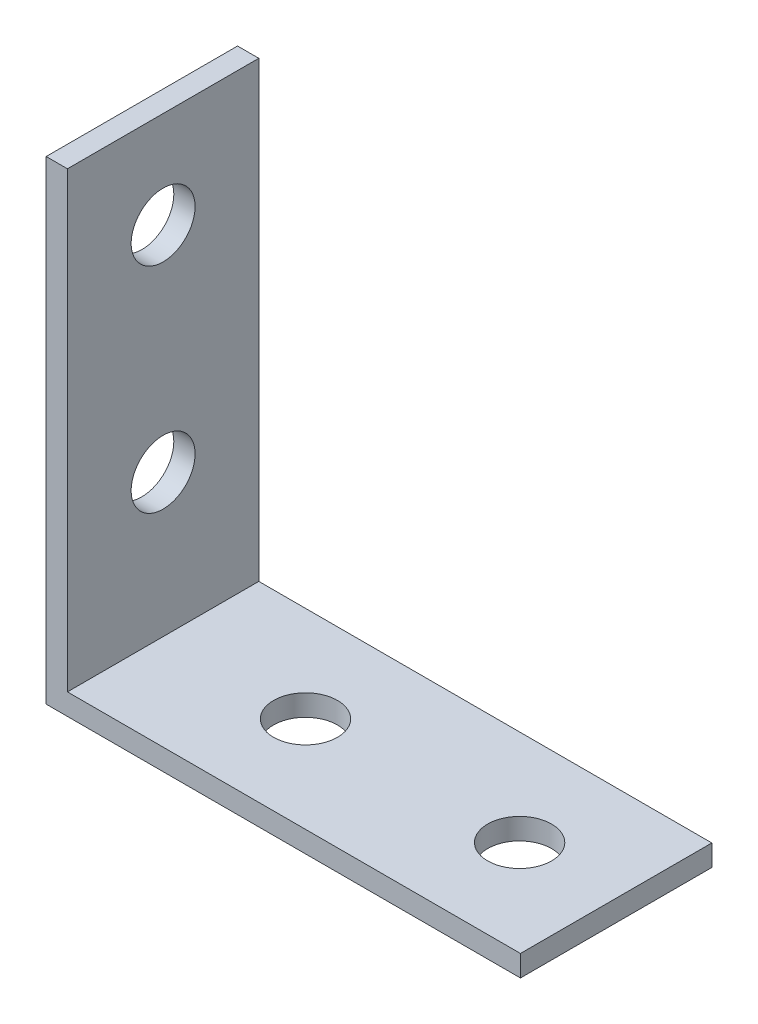
ISO-10303-21;
HEADER;
FILE_DESCRIPTION(('STEP AP214'),'2;1');
FILE_NAME('part.step','',(''),(''),'','','');
FILE_SCHEMA(('AUTOMOTIVE_DESIGN { 1 0 10303 214 1 1 1 1 }'));
ENDSEC;
DATA;
#1=APPLICATION_CONTEXT('core data for automotive mechanical design processes');
#2=APPLICATION_PROTOCOL_DEFINITION('international standard','automotive_design',2000,#1);
#3=PRODUCT_CONTEXT('',#1,'mechanical');
#4=PRODUCT('Part','Part','',(#3));
#5=PRODUCT_RELATED_PRODUCT_CATEGORY('part','',(#4));
#6=PRODUCT_DEFINITION_FORMATION('','',#4);
#7=PRODUCT_DEFINITION_CONTEXT('part definition',#1,'design');
#8=PRODUCT_DEFINITION('design','',#6,#7);
#9=PRODUCT_DEFINITION_SHAPE('','',#8);
#10=(LENGTH_UNIT() NAMED_UNIT(*) SI_UNIT(.MILLI.,.METRE.));
#11=(NAMED_UNIT(*) PLANE_ANGLE_UNIT() SI_UNIT($,.RADIAN.));
#12=(NAMED_UNIT(*) SI_UNIT($,.STERADIAN.) SOLID_ANGLE_UNIT());
#13=UNCERTAINTY_MEASURE_WITH_UNIT(LENGTH_MEASURE(1.E-05),#10,'distance_accuracy_value','');
#14=(GEOMETRIC_REPRESENTATION_CONTEXT(3) GLOBAL_UNCERTAINTY_ASSIGNED_CONTEXT((#13)) GLOBAL_UNIT_ASSIGNED_CONTEXT((#10,
#11,#12)) REPRESENTATION_CONTEXT('',''));
#15=CARTESIAN_POINT('',(0.,0.,0.));
#16=DIRECTION('',(0.,0.,1.));
#17=DIRECTION('',(1.,0.,0.));
#18=AXIS2_PLACEMENT_3D('',#15,#16,#17);
#19=CARTESIAN_POINT('',(0.,1.78,0.));
#20=DIRECTION('',(0.,-1.,0.));
#21=DIRECTION('',(0.,0.,-1.));
#22=AXIS2_PLACEMENT_3D('',#19,#20,#21);
#23=PLANE('',#22);
#24=CARTESIAN_POINT('',(31.62,1.78,-8.01));
#25=DIRECTION('',(0.,1.,0.));
#26=DIRECTION('',(0.,0.,1.));
#27=AXIS2_PLACEMENT_3D('',#24,#25,#26);
#28=CIRCLE('',#27,2.675);
#29=CARTESIAN_POINT('',(31.62,1.78,-5.335));
#30=VERTEX_POINT('',#29);
#31=EDGE_CURVE('E149',#30,#30,#28,.T.);
#32=ORIENTED_EDGE('',*,*,#31,.F.);
#33=EDGE_LOOP('',(#32));
#34=FACE_BOUND('',#33,.T.);
#35=CARTESIAN_POINT('',(13.7,1.78,-8.01));
#36=DIRECTION('',(0.,1.,0.));
#37=DIRECTION('',(0.,0.,1.));
#38=AXIS2_PLACEMENT_3D('',#35,#36,#37);
#39=CIRCLE('',#38,2.675);
#40=CARTESIAN_POINT('',(13.7,1.78,-5.335));
#41=VERTEX_POINT('',#40);
#42=EDGE_CURVE('E99',#41,#41,#39,.T.);
#43=ORIENTED_EDGE('',*,*,#42,.F.);
#44=EDGE_LOOP('',(#43));
#45=FACE_BOUND('',#44,.T.);
#46=DIRECTION('',(0.,0.,-1.));
#47=VECTOR('',#46,1.);
#48=CARTESIAN_POINT('',(1.78,1.78,0.));
#49=LINE('',#48,#47);
#50=CARTESIAN_POINT('',(1.78,1.78,0.));
#51=VERTEX_POINT('',#50);
#52=CARTESIAN_POINT('',(1.78,1.78,-16.02));
#53=VERTEX_POINT('',#52);
#54=EDGE_CURVE('E47',#51,#53,#49,.T.);
#55=ORIENTED_EDGE('',*,*,#54,.F.);
#56=DIRECTION('',(1.,0.,0.));
#57=VECTOR('',#56,1.);
#58=CARTESIAN_POINT('',(0.,1.78,0.));
#59=LINE('',#58,#57);
#60=CARTESIAN_POINT('',(39.7,1.78,0.));
#61=VERTEX_POINT('',#60);
#62=EDGE_CURVE('E84',#51,#61,#59,.T.);
#63=ORIENTED_EDGE('',*,*,#62,.T.);
#64=DIRECTION('',(0.,0.,-1.));
#65=VECTOR('',#64,1.);
#66=CARTESIAN_POINT('',(39.7,1.78,0.));
#67=LINE('',#66,#65);
#68=CARTESIAN_POINT('',(39.7,1.78,-16.02));
#69=VERTEX_POINT('',#68);
#70=EDGE_CURVE('E53',#61,#69,#67,.T.);
#71=ORIENTED_EDGE('',*,*,#70,.T.);
#72=DIRECTION('',(-1.,0.,0.));
#73=VECTOR('',#72,1.);
#74=CARTESIAN_POINT('',(0.,1.78,-16.02));
#75=LINE('',#74,#73);
#76=EDGE_CURVE('E94',#69,#53,#75,.T.);
#77=ORIENTED_EDGE('',*,*,#76,.T.);
#78=EDGE_LOOP('',(#55,#63,#71,#77));
#79=FACE_BOUND('',#78,.T.);
#80=ADVANCED_FACE('F32',(#34,#45,#79),#23,.F.);
#81=CARTESIAN_POINT('',(0.,0.,0.));
#82=DIRECTION('',(0.,-1.,0.));
#83=DIRECTION('',(0.,0.,-1.));
#84=AXIS2_PLACEMENT_3D('',#81,#82,#83);
#85=PLANE('',#84);
#86=CARTESIAN_POINT('',(13.7,0.,-8.01));
#87=DIRECTION('',(0.,1.,0.));
#88=DIRECTION('',(0.,0.,1.));
#89=AXIS2_PLACEMENT_3D('',#86,#87,#88);
#90=CIRCLE('',#89,2.675);
#91=CARTESIAN_POINT('',(13.7,0.,-5.335));
#92=VERTEX_POINT('',#91);
#93=EDGE_CURVE('E103',#92,#92,#90,.T.);
#94=ORIENTED_EDGE('',*,*,#93,.T.);
#95=EDGE_LOOP('',(#94));
#96=FACE_BOUND('',#95,.T.);
#97=DIRECTION('',(0.,0.,1.));
#98=VECTOR('',#97,1.);
#99=CARTESIAN_POINT('',(0.,0.,0.));
#100=LINE('',#99,#98);
#101=CARTESIAN_POINT('',(0.,0.,-16.02));
#102=VERTEX_POINT('',#101);
#103=CARTESIAN_POINT('',(0.,0.,0.));
#104=VERTEX_POINT('',#103);
#105=EDGE_CURVE('E91',#102,#104,#100,.T.);
#106=ORIENTED_EDGE('',*,*,#105,.F.);
#107=DIRECTION('',(-1.,0.,0.));
#108=VECTOR('',#107,1.);
#109=CARTESIAN_POINT('',(0.,0.,-16.02));
#110=LINE('',#109,#108);
#111=CARTESIAN_POINT('',(39.7,0.,-16.02));
#112=VERTEX_POINT('',#111);
#113=EDGE_CURVE('E73',#112,#102,#110,.T.);
#114=ORIENTED_EDGE('',*,*,#113,.F.);
#115=DIRECTION('',(0.,0.,-1.));
#116=VECTOR('',#115,1.);
#117=CARTESIAN_POINT('',(39.7,0.,0.));
#118=LINE('',#117,#116);
#119=CARTESIAN_POINT('',(39.7,0.,0.));
#120=VERTEX_POINT('',#119);
#121=EDGE_CURVE('E85',#120,#112,#118,.T.);
#122=ORIENTED_EDGE('',*,*,#121,.F.);
#123=DIRECTION('',(1.,0.,0.));
#124=VECTOR('',#123,1.);
#125=CARTESIAN_POINT('',(0.,0.,0.));
#126=LINE('',#125,#124);
#127=EDGE_CURVE('E98',#104,#120,#126,.T.);
#128=ORIENTED_EDGE('',*,*,#127,.F.);
#129=EDGE_LOOP('',(#106,#114,#122,#128));
#130=FACE_BOUND('',#129,.T.);
#131=CARTESIAN_POINT('',(31.62,0.,-8.01));
#132=DIRECTION('',(0.,1.,0.));
#133=DIRECTION('',(0.,0.,1.));
#134=AXIS2_PLACEMENT_3D('',#131,#132,#133);
#135=CIRCLE('',#134,2.675);
#136=CARTESIAN_POINT('',(31.62,0.,-5.335));
#137=VERTEX_POINT('',#136);
#138=EDGE_CURVE('E148',#137,#137,#135,.T.);
#139=ORIENTED_EDGE('',*,*,#138,.T.);
#140=EDGE_LOOP('',(#139));
#141=FACE_BOUND('',#140,.T.);
#142=ADVANCED_FACE('F96',(#96,#130,#141),#85,.T.);
#143=CARTESIAN_POINT('',(0.,1.78,0.));
#144=DIRECTION('',(1.,0.,0.));
#145=DIRECTION('',(0.,0.,-1.));
#146=AXIS2_PLACEMENT_3D('',#143,#144,#145);
#147=PLANE('',#146);
#148=CARTESIAN_POINT('',(0.,13.7,-8.01));
#149=DIRECTION('',(1.,0.,0.));
#150=DIRECTION('',(0.,0.,-1.));
#151=AXIS2_PLACEMENT_3D('',#148,#149,#150);
#152=CIRCLE('',#151,2.675);
#153=CARTESIAN_POINT('',(0.,13.7,-10.685));
#154=VERTEX_POINT('',#153);
#155=EDGE_CURVE('E145',#154,#154,#152,.T.);
#156=ORIENTED_EDGE('',*,*,#155,.T.);
#157=EDGE_LOOP('',(#156));
#158=FACE_BOUND('',#157,.T.);
#159=CARTESIAN_POINT('',(0.,31.62,-8.01));
#160=DIRECTION('',(1.,0.,0.));
#161=DIRECTION('',(0.,0.,-1.));
#162=AXIS2_PLACEMENT_3D('',#159,#160,#161);
#163=CIRCLE('',#162,2.675);
#164=CARTESIAN_POINT('',(0.,31.62,-10.685));
#165=VERTEX_POINT('',#164);
#166=EDGE_CURVE('E185',#165,#165,#163,.T.);
#167=ORIENTED_EDGE('',*,*,#166,.T.);
#168=EDGE_LOOP('',(#167));
#169=FACE_BOUND('',#168,.T.);
#170=ORIENTED_EDGE('',*,*,#105,.T.);
#171=DIRECTION('',(0.,-1.,0.));
#172=VECTOR('',#171,1.);
#173=CARTESIAN_POINT('',(0.,1.78,0.));
#174=LINE('',#173,#172);
#175=CARTESIAN_POINT('',(0.,39.7,0.));
#176=VERTEX_POINT('',#175);
#177=EDGE_CURVE('E11',#176,#104,#174,.T.);
#178=ORIENTED_EDGE('',*,*,#177,.F.);
#179=DIRECTION('',(0.,0.,1.));
#180=VECTOR('',#179,1.);
#181=CARTESIAN_POINT('',(0.,39.7,0.));
#182=LINE('',#181,#180);
#183=CARTESIAN_POINT('',(0.,39.7,-16.02));
#184=VERTEX_POINT('',#183);
#185=EDGE_CURVE('E93',#184,#176,#182,.T.);
#186=ORIENTED_EDGE('',*,*,#185,.F.);
#187=DIRECTION('',(0.,-1.,0.));
#188=VECTOR('',#187,1.);
#189=CARTESIAN_POINT('',(0.,1.78,-16.02));
#190=LINE('',#189,#188);
#191=EDGE_CURVE('E77',#184,#102,#190,.T.);
#192=ORIENTED_EDGE('',*,*,#191,.T.);
#193=EDGE_LOOP('',(#170,#178,#186,#192));
#194=FACE_BOUND('',#193,.T.);
#195=ADVANCED_FACE('F34',(#158,#169,#194),#147,.F.);
#196=CARTESIAN_POINT('',(0.,1.78,0.));
#197=DIRECTION('',(0.,0.,-1.));
#198=DIRECTION('',(-1.,0.,0.));
#199=AXIS2_PLACEMENT_3D('',#196,#197,#198);
#200=PLANE('',#199);
#201=ORIENTED_EDGE('',*,*,#127,.T.);
#202=DIRECTION('',(0.,-1.,0.));
#203=VECTOR('',#202,1.);
#204=CARTESIAN_POINT('',(39.7,1.78,0.));
#205=LINE('',#204,#203);
#206=EDGE_CURVE('E40',#61,#120,#205,.T.);
#207=ORIENTED_EDGE('',*,*,#206,.F.);
#208=ORIENTED_EDGE('',*,*,#62,.F.);
#209=DIRECTION('',(0.,-1.,0.));
#210=VECTOR('',#209,1.);
#211=CARTESIAN_POINT('',(1.78,39.7,0.));
#212=LINE('',#211,#210);
#213=CARTESIAN_POINT('',(1.78,39.7,0.));
#214=VERTEX_POINT('',#213);
#215=EDGE_CURVE('E140',#214,#51,#212,.T.);
#216=ORIENTED_EDGE('',*,*,#215,.F.);
#217=DIRECTION('',(1.,0.,0.));
#218=VECTOR('',#217,1.);
#219=CARTESIAN_POINT('',(0.,39.7,0.));
#220=LINE('',#219,#218);
#221=EDGE_CURVE('E120',#176,#214,#220,.T.);
#222=ORIENTED_EDGE('',*,*,#221,.F.);
#223=ORIENTED_EDGE('',*,*,#177,.T.);
#224=EDGE_LOOP('',(#201,#207,#208,#216,#222,#223));
#225=FACE_BOUND('',#224,.T.);
#226=ADVANCED_FACE('F114',(#225),#200,.F.);
#227=CARTESIAN_POINT('',(39.7,1.78,0.));
#228=DIRECTION('',(-1.,0.,0.));
#229=DIRECTION('',(0.,0.,1.));
#230=AXIS2_PLACEMENT_3D('',#227,#228,#229);
#231=PLANE('',#230);
#232=ORIENTED_EDGE('',*,*,#121,.T.);
#233=DIRECTION('',(0.,-1.,0.));
#234=VECTOR('',#233,1.);
#235=CARTESIAN_POINT('',(39.7,1.78,-16.02));
#236=LINE('',#235,#234);
#237=EDGE_CURVE('E80',#69,#112,#236,.T.);
#238=ORIENTED_EDGE('',*,*,#237,.F.);
#239=ORIENTED_EDGE('',*,*,#70,.F.);
#240=ORIENTED_EDGE('',*,*,#206,.T.);
#241=EDGE_LOOP('',(#232,#238,#239,#240));
#242=FACE_BOUND('',#241,.T.);
#243=ADVANCED_FACE('F112',(#242),#231,.F.);
#244=CARTESIAN_POINT('',(0.,1.78,-16.02));
#245=DIRECTION('',(0.,0.,1.));
#246=DIRECTION('',(1.,0.,0.));
#247=AXIS2_PLACEMENT_3D('',#244,#245,#246);
#248=PLANE('',#247);
#249=ORIENTED_EDGE('',*,*,#113,.T.);
#250=ORIENTED_EDGE('',*,*,#191,.F.);
#251=DIRECTION('',(-1.,0.,0.));
#252=VECTOR('',#251,1.);
#253=CARTESIAN_POINT('',(0.,39.7,-16.02));
#254=LINE('',#253,#252);
#255=CARTESIAN_POINT('',(1.78,39.7,-16.02));
#256=VERTEX_POINT('',#255);
#257=EDGE_CURVE('E134',#256,#184,#254,.T.);
#258=ORIENTED_EDGE('',*,*,#257,.F.);
#259=DIRECTION('',(0.,-1.,0.));
#260=VECTOR('',#259,1.);
#261=CARTESIAN_POINT('',(1.78,39.7,-16.02));
#262=LINE('',#261,#260);
#263=EDGE_CURVE('E138',#256,#53,#262,.T.);
#264=ORIENTED_EDGE('',*,*,#263,.T.);
#265=ORIENTED_EDGE('',*,*,#76,.F.);
#266=ORIENTED_EDGE('',*,*,#237,.T.);
#267=EDGE_LOOP('',(#249,#250,#258,#264,#265,#266));
#268=FACE_BOUND('',#267,.T.);
#269=ADVANCED_FACE('F75',(#268),#248,.F.);
#270=CARTESIAN_POINT('',(13.7,1.78,-8.01));
#271=DIRECTION('',(0.,-1.,0.));
#272=DIRECTION('',(0.,0.,-1.));
#273=AXIS2_PLACEMENT_3D('',#270,#271,#272);
#274=CYLINDRICAL_SURFACE('',#273,2.675);
#275=ORIENTED_EDGE('',*,*,#42,.T.);
#276=EDGE_LOOP('',(#275));
#277=FACE_BOUND('',#276,.T.);
#278=ORIENTED_EDGE('',*,*,#93,.F.);
#279=EDGE_LOOP('',(#278));
#280=FACE_BOUND('',#279,.T.);
#281=ADVANCED_FACE('F167',(#277,#280),#274,.F.);
#282=CARTESIAN_POINT('',(31.62,1.78,-8.01));
#283=DIRECTION('',(0.,-1.,0.));
#284=DIRECTION('',(0.,0.,-1.));
#285=AXIS2_PLACEMENT_3D('',#282,#283,#284);
#286=CYLINDRICAL_SURFACE('',#285,2.675);
#287=ORIENTED_EDGE('',*,*,#31,.T.);
#288=EDGE_LOOP('',(#287));
#289=FACE_BOUND('',#288,.T.);
#290=ORIENTED_EDGE('',*,*,#138,.F.);
#291=EDGE_LOOP('',(#290));
#292=FACE_BOUND('',#291,.T.);
#293=ADVANCED_FACE('F201',(#289,#292),#286,.F.);
#294=CARTESIAN_POINT('',(1.78,39.7,0.));
#295=DIRECTION('',(-1.,0.,0.));
#296=DIRECTION('',(0.,0.,1.));
#297=AXIS2_PLACEMENT_3D('',#294,#295,#296);
#298=PLANE('',#297);
#299=CARTESIAN_POINT('',(1.78,13.7,-8.01));
#300=DIRECTION('',(1.,0.,0.));
#301=DIRECTION('',(0.,0.,-1.));
#302=AXIS2_PLACEMENT_3D('',#299,#300,#301);
#303=CIRCLE('',#302,2.675);
#304=CARTESIAN_POINT('',(1.78,13.7,-10.685));
#305=VERTEX_POINT('',#304);
#306=EDGE_CURVE('E187',#305,#305,#303,.T.);
#307=ORIENTED_EDGE('',*,*,#306,.F.);
#308=EDGE_LOOP('',(#307));
#309=FACE_BOUND('',#308,.T.);
#310=CARTESIAN_POINT('',(1.78,31.62,-8.01));
#311=DIRECTION('',(1.,0.,0.));
#312=DIRECTION('',(0.,0.,-1.));
#313=AXIS2_PLACEMENT_3D('',#310,#311,#312);
#314=CIRCLE('',#313,2.675);
#315=CARTESIAN_POINT('',(1.78,31.62,-10.685));
#316=VERTEX_POINT('',#315);
#317=EDGE_CURVE('E191',#316,#316,#314,.T.);
#318=ORIENTED_EDGE('',*,*,#317,.F.);
#319=EDGE_LOOP('',(#318));
#320=FACE_BOUND('',#319,.T.);
#321=ORIENTED_EDGE('',*,*,#54,.T.);
#322=ORIENTED_EDGE('',*,*,#263,.F.);
#323=DIRECTION('',(0.,0.,-1.));
#324=VECTOR('',#323,1.);
#325=CARTESIAN_POINT('',(1.78,39.7,0.));
#326=LINE('',#325,#324);
#327=EDGE_CURVE('E131',#214,#256,#326,.T.);
#328=ORIENTED_EDGE('',*,*,#327,.F.);
#329=ORIENTED_EDGE('',*,*,#215,.T.);
#330=EDGE_LOOP('',(#321,#322,#328,#329));
#331=FACE_BOUND('',#330,.T.);
#332=ADVANCED_FACE('F139',(#309,#320,#331),#298,.F.);
#333=CARTESIAN_POINT('',(0.,39.7,0.));
#334=DIRECTION('',(0.,-1.,0.));
#335=DIRECTION('',(0.,0.,-1.));
#336=AXIS2_PLACEMENT_3D('',#333,#334,#335);
#337=PLANE('',#336);
#338=ORIENTED_EDGE('',*,*,#185,.T.);
#339=ORIENTED_EDGE('',*,*,#221,.T.);
#340=ORIENTED_EDGE('',*,*,#327,.T.);
#341=ORIENTED_EDGE('',*,*,#257,.T.);
#342=EDGE_LOOP('',(#338,#339,#340,#341));
#343=FACE_BOUND('',#342,.T.);
#344=ADVANCED_FACE('F133',(#343),#337,.F.);
#345=CARTESIAN_POINT('',(-36.14,31.62,-8.01));
#346=DIRECTION('',(1.,0.,0.));
#347=DIRECTION('',(0.,0.,-1.));
#348=AXIS2_PLACEMENT_3D('',#345,#346,#347);
#349=CYLINDRICAL_SURFACE('',#348,2.675);
#350=ORIENTED_EDGE('',*,*,#317,.T.);
#351=EDGE_LOOP('',(#350));
#352=FACE_BOUND('',#351,.T.);
#353=ORIENTED_EDGE('',*,*,#166,.F.);
#354=EDGE_LOOP('',(#353));
#355=FACE_BOUND('',#354,.T.);
#356=ADVANCED_FACE('F198',(#352,#355),#349,.F.);
#357=CARTESIAN_POINT('',(-36.14,13.7,-8.01));
#358=DIRECTION('',(1.,0.,0.));
#359=DIRECTION('',(0.,0.,-1.));
#360=AXIS2_PLACEMENT_3D('',#357,#358,#359);
#361=CYLINDRICAL_SURFACE('',#360,2.675);
#362=ORIENTED_EDGE('',*,*,#306,.T.);
#363=EDGE_LOOP('',(#362));
#364=FACE_BOUND('',#363,.T.);
#365=ORIENTED_EDGE('',*,*,#155,.F.);
#366=EDGE_LOOP('',(#365));
#367=FACE_BOUND('',#366,.T.);
#368=ADVANCED_FACE('F214',(#364,#367),#361,.F.);
#369=CLOSED_SHELL('',(#80,#142,#195,#226,#243,#269,#281,#293,#332,#344,#356,#368));
#370=MANIFOLD_SOLID_BREP('B2',#369);
#371=ADVANCED_BREP_SHAPE_REPRESENTATION('',(#18,#370),#14);
#372=SHAPE_DEFINITION_REPRESENTATION(#9,#371);
ENDSEC;
END-ISO-10303-21;
